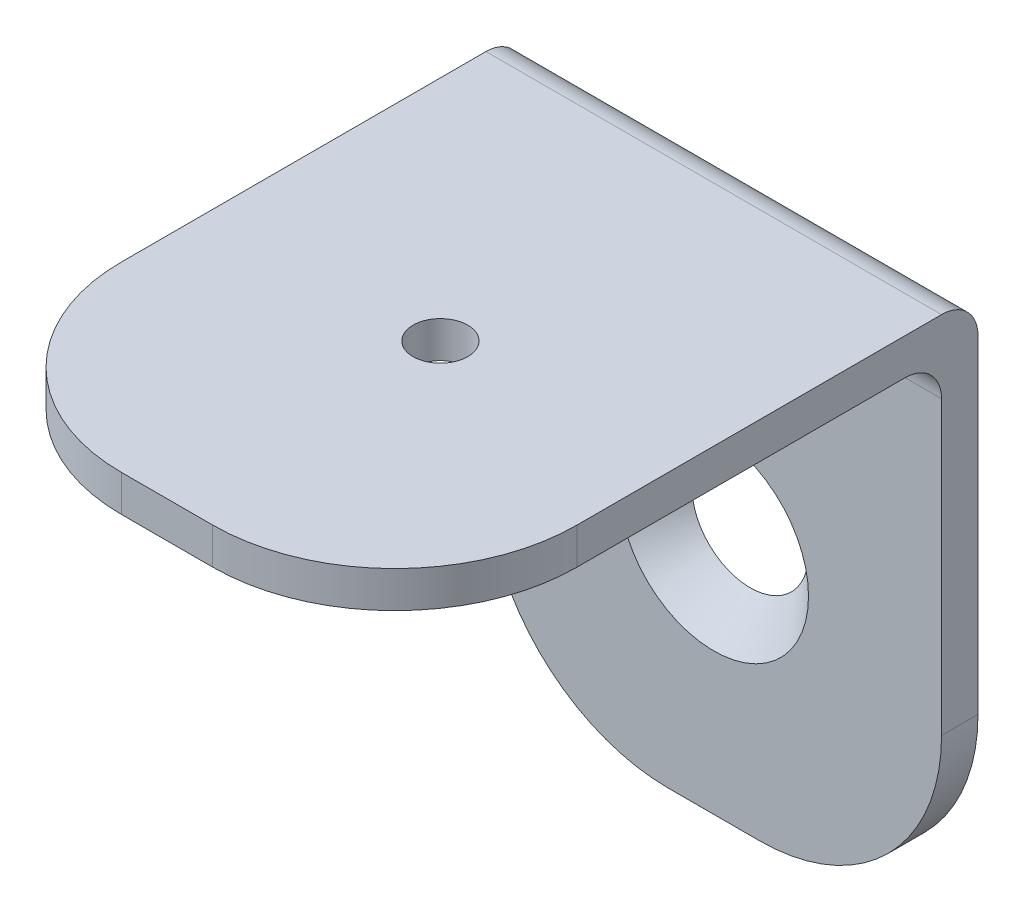
ISO-10303-21;
HEADER;
FILE_DESCRIPTION(('STEP AP214'),'2;1');
FILE_NAME('part.step','',(''),(''),'','','');
FILE_SCHEMA(('AUTOMOTIVE_DESIGN { 1 0 10303 214 1 1 1 1 }'));
ENDSEC;
DATA;
#1=APPLICATION_CONTEXT('core data for automotive mechanical design processes');
#2=APPLICATION_PROTOCOL_DEFINITION('international standard','automotive_design',2000,#1);
#3=PRODUCT_CONTEXT('',#1,'mechanical');
#4=PRODUCT('Part','Part','',(#3));
#5=PRODUCT_RELATED_PRODUCT_CATEGORY('part','',(#4));
#6=PRODUCT_DEFINITION_FORMATION('','',#4);
#7=PRODUCT_DEFINITION_CONTEXT('part definition',#1,'design');
#8=PRODUCT_DEFINITION('design','',#6,#7);
#9=PRODUCT_DEFINITION_SHAPE('','',#8);
#10=(LENGTH_UNIT() NAMED_UNIT(*) SI_UNIT(.MILLI.,.METRE.));
#11=(NAMED_UNIT(*) PLANE_ANGLE_UNIT() SI_UNIT($,.RADIAN.));
#12=(NAMED_UNIT(*) SI_UNIT($,.STERADIAN.) SOLID_ANGLE_UNIT());
#13=UNCERTAINTY_MEASURE_WITH_UNIT(LENGTH_MEASURE(1.E-05),#10,'distance_accuracy_value','');
#14=(GEOMETRIC_REPRESENTATION_CONTEXT(3) GLOBAL_UNCERTAINTY_ASSIGNED_CONTEXT((#13)) GLOBAL_UNIT_ASSIGNED_CONTEXT((#10,
#11,#12)) REPRESENTATION_CONTEXT('',''));
#15=CARTESIAN_POINT('',(0.,0.,0.));
#16=DIRECTION('',(0.,0.,1.));
#17=DIRECTION('',(1.,0.,0.));
#18=AXIS2_PLACEMENT_3D('',#15,#16,#17);
#19=CARTESIAN_POINT('',(12.5,2.,4.99999999999939));
#20=DIRECTION('',(-1.,0.,0.));
#21=DIRECTION('',(0.,0.,1.));
#22=AXIS2_PLACEMENT_3D('',#19,#20,#21);
#23=PLANE('',#22);
#24=DIRECTION('',(0.,-1.,0.));
#25=VECTOR('',#24,1.);
#26=CARTESIAN_POINT('',(12.4999999999993,-18.,-17.0000000000005));
#27=LINE('',#26,#25);
#28=CARTESIAN_POINT('',(12.4999999999993,0.,-17.));
#29=VERTEX_POINT('',#28);
#30=CARTESIAN_POINT('',(12.4999999999993,-18.,-17.0000000000005));
#31=VERTEX_POINT('',#30);
#32=EDGE_CURVE('E128',#29,#31,#27,.T.);
#33=ORIENTED_EDGE('',*,*,#32,.F.);
#34=CARTESIAN_POINT('',(12.5,0.,-15.));
#35=DIRECTION('',(-1.,0.,0.));
#36=DIRECTION('',(0.,0.,1.));
#37=AXIS2_PLACEMENT_3D('',#34,#35,#36);
#38=CIRCLE('',#37,2.);
#39=CARTESIAN_POINT('',(12.5,2.,-15.0000000000005));
#40=VERTEX_POINT('',#39);
#41=EDGE_CURVE('E63',#29,#40,#38,.F.);
#42=ORIENTED_EDGE('',*,*,#41,.T.);
#43=DIRECTION('',(0.,0.,-1.));
#44=VECTOR('',#43,1.);
#45=CARTESIAN_POINT('',(12.5,2.,4.99999999999939));
#46=LINE('',#45,#44);
#47=CARTESIAN_POINT('',(12.5,2.,4.99999999999939));
#48=VERTEX_POINT('',#47);
#49=EDGE_CURVE('E176',#48,#40,#46,.T.);
#50=ORIENTED_EDGE('',*,*,#49,.F.);
#51=DIRECTION('',(0.,-1.,0.));
#52=VECTOR('',#51,1.);
#53=CARTESIAN_POINT('',(12.5,2.,4.99999999999939));
#54=LINE('',#53,#52);
#55=CARTESIAN_POINT('',(12.5,0.,4.99999999999995));
#56=VERTEX_POINT('',#55);
#57=EDGE_CURVE('E187',#48,#56,#54,.T.);
#58=ORIENTED_EDGE('',*,*,#57,.T.);
#59=DIRECTION('',(0.,0.,-1.));
#60=VECTOR('',#59,1.);
#61=CARTESIAN_POINT('',(12.5,0.,4.99999999999995));
#62=LINE('',#61,#60);
#63=CARTESIAN_POINT('',(12.4999999999994,0.,-13.));
#64=VERTEX_POINT('',#63);
#65=EDGE_CURVE('E145',#56,#64,#62,.T.);
#66=ORIENTED_EDGE('',*,*,#65,.T.);
#67=CARTESIAN_POINT('',(12.4999999999994,-2.,-13.0000000000005));
#68=DIRECTION('',(-1.,0.,0.));
#69=DIRECTION('',(0.,0.,1.));
#70=AXIS2_PLACEMENT_3D('',#67,#68,#69);
#71=CIRCLE('',#70,2.);
#72=CARTESIAN_POINT('',(12.5,-2.,-15.0000000000005));
#73=VERTEX_POINT('',#72);
#74=EDGE_CURVE('E215',#64,#73,#71,.T.);
#75=ORIENTED_EDGE('',*,*,#74,.T.);
#76=DIRECTION('',(0.,-1.,0.));
#77=VECTOR('',#76,1.);
#78=CARTESIAN_POINT('',(12.5,-18.,-15.0000000000005));
#79=LINE('',#78,#77);
#80=CARTESIAN_POINT('',(12.5,-18.,-15.0000000000005));
#81=VERTEX_POINT('',#80);
#82=EDGE_CURVE('E142',#73,#81,#79,.T.);
#83=ORIENTED_EDGE('',*,*,#82,.T.);
#84=DIRECTION('',(0.,0.,1.));
#85=VECTOR('',#84,1.);
#86=CARTESIAN_POINT('',(12.4999999999993,-18.,-17.0000000000005));
#87=LINE('',#86,#85);
#88=EDGE_CURVE('E140',#31,#81,#87,.T.);
#89=ORIENTED_EDGE('',*,*,#88,.F.);
#90=EDGE_LOOP('',(#33,#42,#50,#58,#66,#75,#83,#89));
#91=FACE_BOUND('',#90,.T.);
#92=ADVANCED_FACE('F41',(#91),#23,.F.);
#93=CARTESIAN_POINT('',(-12.5,2.,5.00000000000123));
#94=DIRECTION('',(1.,0.,0.));
#95=DIRECTION('',(0.,0.,-1.));
#96=AXIS2_PLACEMENT_3D('',#93,#94,#95);
#97=PLANE('',#96);
#98=DIRECTION('',(0.,0.,1.));
#99=VECTOR('',#98,1.);
#100=CARTESIAN_POINT('',(-12.5,2.,5.00000000000123));
#101=LINE('',#100,#99);
#102=CARTESIAN_POINT('',(-12.5,2.,-14.9999999999987));
#103=VERTEX_POINT('',#102);
#104=CARTESIAN_POINT('',(-12.5,2.,5.00000000000123));
#105=VERTEX_POINT('',#104);
#106=EDGE_CURVE('E178',#103,#105,#101,.T.);
#107=ORIENTED_EDGE('',*,*,#106,.F.);
#108=CARTESIAN_POINT('',(-12.5,0.,-15.));
#109=DIRECTION('',(1.,0.,0.));
#110=DIRECTION('',(0.,0.,-1.));
#111=AXIS2_PLACEMENT_3D('',#108,#109,#110);
#112=CIRCLE('',#111,2.);
#113=CARTESIAN_POINT('',(-12.5000000000007,0.,-17.));
#114=VERTEX_POINT('',#113);
#115=EDGE_CURVE('E11',#103,#114,#112,.F.);
#116=ORIENTED_EDGE('',*,*,#115,.T.);
#117=DIRECTION('',(0.,1.,0.));
#118=VECTOR('',#117,1.);
#119=CARTESIAN_POINT('',(-12.5000000000007,-18.,-16.9999999999987));
#120=LINE('',#119,#118);
#121=CARTESIAN_POINT('',(-12.5000000000007,-18.,-16.9999999999987));
#122=VERTEX_POINT('',#121);
#123=EDGE_CURVE('E137',#122,#114,#120,.T.);
#124=ORIENTED_EDGE('',*,*,#123,.F.);
#125=DIRECTION('',(0.,0.,1.));
#126=VECTOR('',#125,1.);
#127=CARTESIAN_POINT('',(-12.5000000000007,-18.,-16.9999999999987));
#128=LINE('',#127,#126);
#129=CARTESIAN_POINT('',(-12.5,-18.,-14.9999999999987));
#130=VERTEX_POINT('',#129);
#131=EDGE_CURVE('E158',#122,#130,#128,.T.);
#132=ORIENTED_EDGE('',*,*,#131,.T.);
#133=DIRECTION('',(0.,1.,0.));
#134=VECTOR('',#133,1.);
#135=CARTESIAN_POINT('',(-12.5,-18.,-14.9999999999987));
#136=LINE('',#135,#134);
#137=CARTESIAN_POINT('',(-12.5,-2.,-14.9999999999987));
#138=VERTEX_POINT('',#137);
#139=EDGE_CURVE('E159',#130,#138,#136,.T.);
#140=ORIENTED_EDGE('',*,*,#139,.T.);
#141=CARTESIAN_POINT('',(-12.5000000000007,-2.,-12.9999999999987));
#142=DIRECTION('',(1.,0.,0.));
#143=DIRECTION('',(0.,0.,-1.));
#144=AXIS2_PLACEMENT_3D('',#141,#142,#143);
#145=CIRCLE('',#144,2.);
#146=CARTESIAN_POINT('',(-12.5000000000007,0.,-13.));
#147=VERTEX_POINT('',#146);
#148=EDGE_CURVE('E213',#138,#147,#145,.T.);
#149=ORIENTED_EDGE('',*,*,#148,.T.);
#150=DIRECTION('',(0.,0.,1.));
#151=VECTOR('',#150,1.);
#152=CARTESIAN_POINT('',(-12.5,0.,4.99999999999992));
#153=LINE('',#152,#151);
#154=CARTESIAN_POINT('',(-12.5,0.,4.99999999999992));
#155=VERTEX_POINT('',#154);
#156=EDGE_CURVE('E190',#147,#155,#153,.T.);
#157=ORIENTED_EDGE('',*,*,#156,.T.);
#158=DIRECTION('',(0.,-1.,0.));
#159=VECTOR('',#158,1.);
#160=CARTESIAN_POINT('',(-12.5,2.,5.00000000000123));
#161=LINE('',#160,#159);
#162=EDGE_CURVE('E205',#105,#155,#161,.T.);
#163=ORIENTED_EDGE('',*,*,#162,.F.);
#164=EDGE_LOOP('',(#107,#116,#124,#132,#140,#149,#157,#163));
#165=FACE_BOUND('',#164,.T.);
#166=ADVANCED_FACE('F230',(#165),#97,.F.);
#167=CARTESIAN_POINT('',(-2.5,2.,4.99999999999945));
#168=DIRECTION('',(0.,-1.,0.));
#169=DIRECTION('',(0.,0.,-1.));
#170=AXIS2_PLACEMENT_3D('',#167,#168,#169);
#171=CYLINDRICAL_SURFACE('',#170,10.);
#172=CARTESIAN_POINT('',(-2.5,0.,5.));
#173=DIRECTION('',(0.,1.,0.));
#174=DIRECTION('',(0.,0.,-1.));
#175=AXIS2_PLACEMENT_3D('',#172,#173,#174);
#176=CIRCLE('',#175,10.);
#177=CARTESIAN_POINT('',(-2.50000000000095,0.,15.));
#178=VERTEX_POINT('',#177);
#179=EDGE_CURVE('E192',#155,#178,#176,.T.);
#180=ORIENTED_EDGE('',*,*,#179,.T.);
#181=DIRECTION('',(0.,-1.,0.));
#182=VECTOR('',#181,1.);
#183=CARTESIAN_POINT('',(-2.50000000000095,2.,14.9999999999995));
#184=LINE('',#183,#182);
#185=CARTESIAN_POINT('',(-2.50000000000095,2.,14.9999999999995));
#186=VERTEX_POINT('',#185);
#187=EDGE_CURVE('E202',#186,#178,#184,.T.);
#188=ORIENTED_EDGE('',*,*,#187,.F.);
#189=CARTESIAN_POINT('',(-2.5,2.,4.99999999999945));
#190=DIRECTION('',(0.,1.,0.));
#191=DIRECTION('',(0.,0.,-1.));
#192=AXIS2_PLACEMENT_3D('',#189,#190,#191);
#193=CIRCLE('',#192,10.);
#194=EDGE_CURVE('E181',#105,#186,#193,.T.);
#195=ORIENTED_EDGE('',*,*,#194,.F.);
#196=ORIENTED_EDGE('',*,*,#162,.T.);
#197=EDGE_LOOP('',(#180,#188,#195,#196));
#198=FACE_BOUND('',#197,.T.);
#199=ADVANCED_FACE('F239',(#198),#171,.T.);
#200=CARTESIAN_POINT('',(-2.50000000000095,2.,14.9999999999995));
#201=DIRECTION('',(0.,0.,-1.));
#202=DIRECTION('',(-1.,0.,0.));
#203=AXIS2_PLACEMENT_3D('',#200,#201,#202);
#204=PLANE('',#203);
#205=DIRECTION('',(1.,0.,0.));
#206=VECTOR('',#205,1.);
#207=CARTESIAN_POINT('',(-2.50000000000095,0.,15.));
#208=LINE('',#207,#206);
#209=CARTESIAN_POINT('',(2.49999999999891,0.,15.));
#210=VERTEX_POINT('',#209);
#211=EDGE_CURVE('E194',#178,#210,#208,.T.);
#212=ORIENTED_EDGE('',*,*,#211,.T.);
#213=DIRECTION('',(0.,-1.,0.));
#214=VECTOR('',#213,1.);
#215=CARTESIAN_POINT('',(2.49999999999891,2.,15.0000000000013));
#216=LINE('',#215,#214);
#217=CARTESIAN_POINT('',(2.49999999999891,2.,15.0000000000013));
#218=VERTEX_POINT('',#217);
#219=EDGE_CURVE('E199',#218,#210,#216,.T.);
#220=ORIENTED_EDGE('',*,*,#219,.F.);
#221=DIRECTION('',(1.,0.,0.));
#222=VECTOR('',#221,1.);
#223=CARTESIAN_POINT('',(-2.50000000000095,2.,14.9999999999995));
#224=LINE('',#223,#222);
#225=EDGE_CURVE('E183',#186,#218,#224,.T.);
#226=ORIENTED_EDGE('',*,*,#225,.F.);
#227=ORIENTED_EDGE('',*,*,#187,.T.);
#228=EDGE_LOOP('',(#212,#220,#226,#227));
#229=FACE_BOUND('',#228,.T.);
#230=ADVANCED_FACE('F243',(#229),#204,.F.);
#231=CARTESIAN_POINT('',(2.5,2.,5.00000000000131));
#232=DIRECTION('',(0.,-1.,0.));
#233=DIRECTION('',(0.,0.,-1.));
#234=AXIS2_PLACEMENT_3D('',#231,#232,#233);
#235=CYLINDRICAL_SURFACE('',#234,10.);
#236=CARTESIAN_POINT('',(2.5,0.,5.));
#237=DIRECTION('',(0.,1.,0.));
#238=DIRECTION('',(0.,0.,1.));
#239=AXIS2_PLACEMENT_3D('',#236,#237,#238);
#240=CIRCLE('',#239,10.);
#241=EDGE_CURVE('E179',#210,#56,#240,.T.);
#242=ORIENTED_EDGE('',*,*,#241,.T.);
#243=ORIENTED_EDGE('',*,*,#57,.F.);
#244=CARTESIAN_POINT('',(2.5,2.,5.00000000000131));
#245=DIRECTION('',(0.,1.,0.));
#246=DIRECTION('',(0.,0.,1.));
#247=AXIS2_PLACEMENT_3D('',#244,#245,#246);
#248=CIRCLE('',#247,10.);
#249=EDGE_CURVE('E185',#218,#48,#248,.T.);
#250=ORIENTED_EDGE('',*,*,#249,.F.);
#251=ORIENTED_EDGE('',*,*,#219,.T.);
#252=EDGE_LOOP('',(#242,#243,#250,#251));
#253=FACE_BOUND('',#252,.T.);
#254=ADVANCED_FACE('F271',(#253),#235,.T.);
#255=CARTESIAN_POINT('',(-2.5,2.,4.99999999999945));
#256=DIRECTION('',(0.,-1.,0.));
#257=DIRECTION('',(0.,0.,-1.));
#258=AXIS2_PLACEMENT_3D('',#255,#256,#257);
#259=PLANE('',#258);
#260=CARTESIAN_POINT('',(0.,2.,1.30451205393456E-12));
#261=DIRECTION('',(0.,-1.,0.));
#262=DIRECTION('',(0.,0.,-1.));
#263=AXIS2_PLACEMENT_3D('',#260,#261,#262);
#264=CIRCLE('',#263,1.5);
#265=CARTESIAN_POINT('',(0.,2.,-1.4999999999987));
#266=VERTEX_POINT('',#265);
#267=EDGE_CURVE('E307',#266,#266,#264,.T.);
#268=ORIENTED_EDGE('',*,*,#267,.T.);
#269=EDGE_LOOP('',(#268));
#270=FACE_BOUND('',#269,.T.);
#271=ORIENTED_EDGE('',*,*,#49,.T.);
#272=DIRECTION('',(1.,0.,0.));
#273=VECTOR('',#272,1.);
#274=CARTESIAN_POINT('',(-2.5,2.,-15.0000000000006));
#275=LINE('',#274,#273);
#276=EDGE_CURVE('E49',#40,#103,#275,.F.);
#277=ORIENTED_EDGE('',*,*,#276,.T.);
#278=ORIENTED_EDGE('',*,*,#106,.T.);
#279=ORIENTED_EDGE('',*,*,#194,.T.);
#280=ORIENTED_EDGE('',*,*,#225,.T.);
#281=ORIENTED_EDGE('',*,*,#249,.T.);
#282=EDGE_LOOP('',(#271,#277,#278,#279,#280,#281));
#283=FACE_BOUND('',#282,.T.);
#284=ADVANCED_FACE('F246',(#270,#283),#259,.F.);
#285=CARTESIAN_POINT('',(-2.5,0.,5.));
#286=DIRECTION('',(0.,-1.,0.));
#287=DIRECTION('',(0.,0.,-1.));
#288=AXIS2_PLACEMENT_3D('',#285,#286,#287);
#289=PLANE('',#288);
#290=CARTESIAN_POINT('',(0.,0.,0.));
#291=DIRECTION('',(0.,-1.,0.));
#292=DIRECTION('',(0.,0.,-1.));
#293=AXIS2_PLACEMENT_3D('',#290,#291,#292);
#294=CIRCLE('',#293,1.5);
#295=CARTESIAN_POINT('',(0.,0.,-1.5));
#296=VERTEX_POINT('',#295);
#297=EDGE_CURVE('E304',#296,#296,#294,.T.);
#298=ORIENTED_EDGE('',*,*,#297,.F.);
#299=EDGE_LOOP('',(#298));
#300=FACE_BOUND('',#299,.T.);
#301=ORIENTED_EDGE('',*,*,#156,.F.);
#302=DIRECTION('',(-1.,0.,0.));
#303=VECTOR('',#302,1.);
#304=CARTESIAN_POINT('',(12.4999999999994,0.,-13.));
#305=LINE('',#304,#303);
#306=EDGE_CURVE('E211',#147,#64,#305,.F.);
#307=ORIENTED_EDGE('',*,*,#306,.T.);
#308=ORIENTED_EDGE('',*,*,#65,.F.);
#309=ORIENTED_EDGE('',*,*,#241,.F.);
#310=ORIENTED_EDGE('',*,*,#211,.F.);
#311=ORIENTED_EDGE('',*,*,#179,.F.);
#312=EDGE_LOOP('',(#301,#307,#308,#309,#310,#311));
#313=FACE_BOUND('',#312,.T.);
#314=ADVANCED_FACE('F234',(#300,#313),#289,.T.);
#315=CARTESIAN_POINT('',(2.49999999999935,-18.,-16.9999999999998));
#316=DIRECTION('',(0.,0.,1.));
#317=DIRECTION('',(1.,0.,0.));
#318=AXIS2_PLACEMENT_3D('',#315,#316,#317);
#319=CYLINDRICAL_SURFACE('',#318,10.);
#320=CARTESIAN_POINT('',(2.5,-18.,-14.9999999999987));
#321=DIRECTION('',(0.,0.,-1.));
#322=DIRECTION('',(1.,0.,0.));
#323=AXIS2_PLACEMENT_3D('',#320,#321,#322);
#324=CIRCLE('',#323,10.);
#325=CARTESIAN_POINT('',(2.49999999999999,-28.,-14.9999999999987));
#326=VERTEX_POINT('',#325);
#327=EDGE_CURVE('E164',#81,#326,#324,.T.);
#328=ORIENTED_EDGE('',*,*,#327,.T.);
#329=DIRECTION('',(0.,0.,1.));
#330=VECTOR('',#329,1.);
#331=CARTESIAN_POINT('',(2.49999999999935,-28.,-16.9999999999987));
#332=LINE('',#331,#330);
#333=CARTESIAN_POINT('',(2.49999999999935,-28.,-16.9999999999987));
#334=VERTEX_POINT('',#333);
#335=EDGE_CURVE('E146',#334,#326,#332,.T.);
#336=ORIENTED_EDGE('',*,*,#335,.F.);
#337=CARTESIAN_POINT('',(2.49999999999935,-18.,-16.9999999999998));
#338=DIRECTION('',(0.,0.,-1.));
#339=DIRECTION('',(1.,0.,0.));
#340=AXIS2_PLACEMENT_3D('',#337,#338,#339);
#341=CIRCLE('',#340,10.);
#342=EDGE_CURVE('E133',#31,#334,#341,.T.);
#343=ORIENTED_EDGE('',*,*,#342,.F.);
#344=ORIENTED_EDGE('',*,*,#88,.T.);
#345=EDGE_LOOP('',(#328,#336,#343,#344));
#346=FACE_BOUND('',#345,.T.);
#347=ADVANCED_FACE('F148',(#346),#319,.T.);
#348=CARTESIAN_POINT('',(2.49999999999935,-28.,-16.9999999999987));
#349=DIRECTION('',(0.,1.,0.));
#350=DIRECTION('',(0.,0.,1.));
#351=AXIS2_PLACEMENT_3D('',#348,#349,#350);
#352=PLANE('',#351);
#353=DIRECTION('',(-1.,0.,0.));
#354=VECTOR('',#353,1.);
#355=CARTESIAN_POINT('',(2.5,-28.,-14.9999999999987));
#356=LINE('',#355,#354);
#357=CARTESIAN_POINT('',(-2.5,-28.,-15.0000000000006));
#358=VERTEX_POINT('',#357);
#359=EDGE_CURVE('E166',#326,#358,#356,.T.);
#360=ORIENTED_EDGE('',*,*,#359,.T.);
#361=DIRECTION('',(0.,0.,1.));
#362=VECTOR('',#361,1.);
#363=CARTESIAN_POINT('',(-2.50000000000065,-28.,-17.0000000000006));
#364=LINE('',#363,#362);
#365=CARTESIAN_POINT('',(-2.50000000000065,-28.,-17.0000000000006));
#366=VERTEX_POINT('',#365);
#367=EDGE_CURVE('E172',#366,#358,#364,.T.);
#368=ORIENTED_EDGE('',*,*,#367,.F.);
#369=DIRECTION('',(-1.,0.,0.));
#370=VECTOR('',#369,1.);
#371=CARTESIAN_POINT('',(2.49999999999935,-28.,-16.9999999999987));
#372=LINE('',#371,#370);
#373=EDGE_CURVE('E151',#334,#366,#372,.T.);
#374=ORIENTED_EDGE('',*,*,#373,.F.);
#375=ORIENTED_EDGE('',*,*,#335,.T.);
#376=EDGE_LOOP('',(#360,#368,#374,#375));
#377=FACE_BOUND('',#376,.T.);
#378=ADVANCED_FACE('F283',(#377),#352,.F.);
#379=CARTESIAN_POINT('',(-2.50000000000065,-18.,-17.0000000000006));
#380=DIRECTION('',(0.,0.,1.));
#381=DIRECTION('',(1.,0.,0.));
#382=AXIS2_PLACEMENT_3D('',#379,#380,#381);
#383=CYLINDRICAL_SURFACE('',#382,10.);
#384=CARTESIAN_POINT('',(-2.5,-18.,-15.0000000000006));
#385=DIRECTION('',(0.,0.,-1.));
#386=DIRECTION('',(-1.,0.,0.));
#387=AXIS2_PLACEMENT_3D('',#384,#385,#386);
#388=CIRCLE('',#387,10.);
#389=EDGE_CURVE('E168',#358,#130,#388,.T.);
#390=ORIENTED_EDGE('',*,*,#389,.T.);
#391=ORIENTED_EDGE('',*,*,#131,.F.);
#392=CARTESIAN_POINT('',(-2.50000000000065,-18.,-17.0000000000006));
#393=DIRECTION('',(0.,0.,-1.));
#394=DIRECTION('',(-1.,0.,0.));
#395=AXIS2_PLACEMENT_3D('',#392,#393,#394);
#396=CIRCLE('',#395,10.);
#397=EDGE_CURVE('E153',#366,#122,#396,.T.);
#398=ORIENTED_EDGE('',*,*,#397,.F.);
#399=ORIENTED_EDGE('',*,*,#367,.T.);
#400=EDGE_LOOP('',(#390,#391,#398,#399));
#401=FACE_BOUND('',#400,.T.);
#402=ADVANCED_FACE('F286',(#401),#383,.T.);
#403=CARTESIAN_POINT('',(2.49999999999935,-18.,-16.9999999999998));
#404=DIRECTION('',(0.,0.,1.));
#405=DIRECTION('',(1.,0.,0.));
#406=AXIS2_PLACEMENT_3D('',#403,#404,#405);
#407=PLANE('',#406);
#408=CARTESIAN_POINT('',(-6.52256026967279E-13,-15.0342478014989,-16.9999999999987));
#409=DIRECTION('',(0.,0.,1.));
#410=DIRECTION('',(1.,0.,0.));
#411=AXIS2_PLACEMENT_3D('',#408,#409,#410);
#412=CIRCLE('',#411,3.19999999999999);
#413=CARTESIAN_POINT('',(3.19999999999934,-15.0342478014989,-16.9999999999987));
#414=VERTEX_POINT('',#413);
#415=EDGE_CURVE('E162',#414,#414,#412,.T.);
#416=ORIENTED_EDGE('',*,*,#415,.T.);
#417=EDGE_LOOP('',(#416));
#418=FACE_BOUND('',#417,.T.);
#419=ORIENTED_EDGE('',*,*,#123,.T.);
#420=DIRECTION('',(1.,0.,0.));
#421=VECTOR('',#420,1.);
#422=CARTESIAN_POINT('',(2.49999999999935,0.,-17.));
#423=LINE('',#422,#421);
#424=EDGE_CURVE('E136',#114,#29,#423,.T.);
#425=ORIENTED_EDGE('',*,*,#424,.T.);
#426=ORIENTED_EDGE('',*,*,#32,.T.);
#427=ORIENTED_EDGE('',*,*,#342,.T.);
#428=ORIENTED_EDGE('',*,*,#373,.T.);
#429=ORIENTED_EDGE('',*,*,#397,.T.);
#430=EDGE_LOOP('',(#419,#425,#426,#427,#428,#429));
#431=FACE_BOUND('',#430,.T.);
#432=ADVANCED_FACE('F131',(#418,#431),#407,.F.);
#433=CARTESIAN_POINT('',(2.5,-18.,-14.9999999999987));
#434=DIRECTION('',(0.,0.,1.));
#435=DIRECTION('',(1.,0.,0.));
#436=AXIS2_PLACEMENT_3D('',#433,#434,#435);
#437=PLANE('',#436);
#438=CARTESIAN_POINT('',(0.,-15.0342478014989,-14.9999999999987));
#439=DIRECTION('',(0.,0.,1.));
#440=DIRECTION('',(1.,0.,0.));
#441=AXIS2_PLACEMENT_3D('',#438,#439,#440);
#442=CIRCLE('',#441,5.2);
#443=CARTESIAN_POINT('',(5.2,-15.0342478014989,-14.9999999999987));
#444=VERTEX_POINT('',#443);
#445=EDGE_CURVE('E308',#444,#444,#442,.T.);
#446=ORIENTED_EDGE('',*,*,#445,.F.);
#447=EDGE_LOOP('',(#446));
#448=FACE_BOUND('',#447,.T.);
#449=ORIENTED_EDGE('',*,*,#82,.F.);
#450=DIRECTION('',(-1.,0.,0.));
#451=VECTOR('',#450,1.);
#452=CARTESIAN_POINT('',(-12.5,-2.,-14.9999999999987));
#453=LINE('',#452,#451);
#454=EDGE_CURVE('E208',#73,#138,#453,.T.);
#455=ORIENTED_EDGE('',*,*,#454,.T.);
#456=ORIENTED_EDGE('',*,*,#139,.F.);
#457=ORIENTED_EDGE('',*,*,#389,.F.);
#458=ORIENTED_EDGE('',*,*,#359,.F.);
#459=ORIENTED_EDGE('',*,*,#327,.F.);
#460=EDGE_LOOP('',(#449,#455,#456,#457,#458,#459));
#461=FACE_BOUND('',#460,.T.);
#462=ADVANCED_FACE('F224',(#448,#461),#437,.T.);
#463=CARTESIAN_POINT('',(2.49999999999935,-2.,-12.9999999999987));
#464=DIRECTION('',(1.,0.,0.));
#465=DIRECTION('',(0.,0.,-1.));
#466=AXIS2_PLACEMENT_3D('',#463,#464,#465);
#467=CYLINDRICAL_SURFACE('',#466,2.);
#468=ORIENTED_EDGE('',*,*,#74,.F.);
#469=ORIENTED_EDGE('',*,*,#306,.F.);
#470=ORIENTED_EDGE('',*,*,#148,.F.);
#471=ORIENTED_EDGE('',*,*,#454,.F.);
#472=EDGE_LOOP('',(#468,#469,#470,#471));
#473=FACE_BOUND('',#472,.T.);
#474=ADVANCED_FACE('F227',(#473),#467,.F.);
#475=CARTESIAN_POINT('',(2.5,0.,-15.));
#476=DIRECTION('',(1.,0.,0.));
#477=DIRECTION('',(0.,0.,-1.));
#478=AXIS2_PLACEMENT_3D('',#475,#476,#477);
#479=CYLINDRICAL_SURFACE('',#478,2.);
#480=ORIENTED_EDGE('',*,*,#115,.F.);
#481=ORIENTED_EDGE('',*,*,#276,.F.);
#482=ORIENTED_EDGE('',*,*,#41,.F.);
#483=ORIENTED_EDGE('',*,*,#424,.F.);
#484=EDGE_LOOP('',(#480,#481,#482,#483));
#485=FACE_BOUND('',#484,.T.);
#486=ADVANCED_FACE('F43',(#485),#479,.T.);
#487=CARTESIAN_POINT('',(0.,-15.0342478014989,-14.9999999999987));
#488=DIRECTION('',(0.,0.,1.));
#489=DIRECTION('',(1.,0.,0.));
#490=AXIS2_PLACEMENT_3D('',#487,#488,#489);
#491=CONICAL_SURFACE('',#490,5.2,0.785398163397449);
#492=ORIENTED_EDGE('',*,*,#445,.T.);
#493=EDGE_LOOP('',(#492));
#494=FACE_BOUND('',#493,.T.);
#495=ORIENTED_EDGE('',*,*,#415,.F.);
#496=EDGE_LOOP('',(#495));
#497=FACE_BOUND('',#496,.T.);
#498=ADVANCED_FACE('F252',(#494,#497),#491,.F.);
#499=CARTESIAN_POINT('',(0.,9.99999999999999,1.30451205393456E-12));
#500=DIRECTION('',(0.,-1.,0.));
#501=DIRECTION('',(0.,0.,-1.));
#502=AXIS2_PLACEMENT_3D('',#499,#500,#501);
#503=CYLINDRICAL_SURFACE('',#502,1.5);
#504=ORIENTED_EDGE('',*,*,#297,.T.);
#505=EDGE_LOOP('',(#504));
#506=FACE_BOUND('',#505,.T.);
#507=ORIENTED_EDGE('',*,*,#267,.F.);
#508=EDGE_LOOP('',(#507));
#509=FACE_BOUND('',#508,.T.);
#510=ADVANCED_FACE('F257',(#506,#509),#503,.F.);
#511=CLOSED_SHELL('',(#92,#166,#199,#230,#254,#284,#314,#347,#378,#402,#432,#462,#474,#486,#498,#510));
#512=MANIFOLD_SOLID_BREP('B2',#511);
#513=ADVANCED_BREP_SHAPE_REPRESENTATION('',(#18,#512),#14);
#514=SHAPE_DEFINITION_REPRESENTATION(#9,#513);
ENDSEC;
END-ISO-10303-21;
